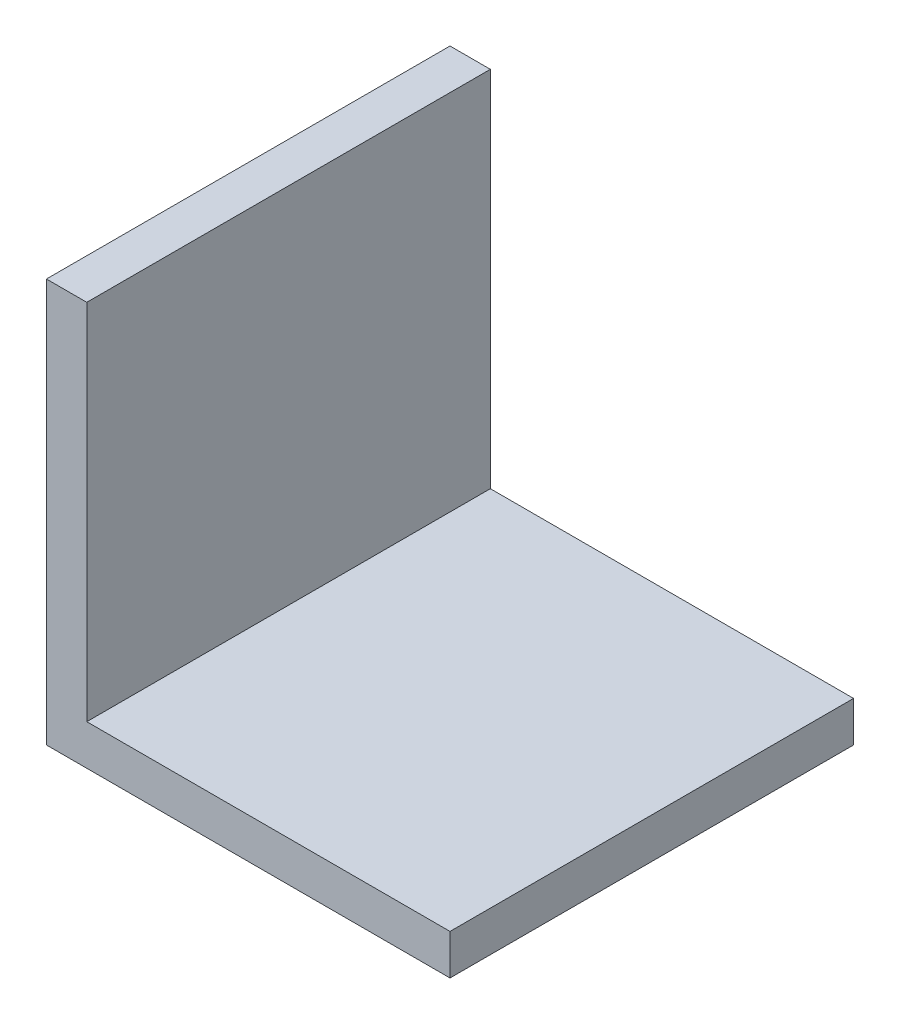
ISO-10303-21;
HEADER;
FILE_DESCRIPTION(('STEP AP214'),'2;1');
FILE_NAME('part.step','',(''),(''),'','','');
FILE_SCHEMA(('AUTOMOTIVE_DESIGN { 1 0 10303 214 1 1 1 1 }'));
ENDSEC;
DATA;
#1=APPLICATION_CONTEXT('core data for automotive mechanical design processes');
#2=APPLICATION_PROTOCOL_DEFINITION('international standard','automotive_design',2000,#1);
#3=PRODUCT_CONTEXT('',#1,'mechanical');
#4=PRODUCT('Part','Part','',(#3));
#5=PRODUCT_RELATED_PRODUCT_CATEGORY('part','',(#4));
#6=PRODUCT_DEFINITION_FORMATION('','',#4);
#7=PRODUCT_DEFINITION_CONTEXT('part definition',#1,'design');
#8=PRODUCT_DEFINITION('design','',#6,#7);
#9=PRODUCT_DEFINITION_SHAPE('','',#8);
#10=(LENGTH_UNIT() NAMED_UNIT(*) SI_UNIT(.MILLI.,.METRE.));
#11=(NAMED_UNIT(*) PLANE_ANGLE_UNIT() SI_UNIT($,.RADIAN.));
#12=(NAMED_UNIT(*) SI_UNIT($,.STERADIAN.) SOLID_ANGLE_UNIT());
#13=UNCERTAINTY_MEASURE_WITH_UNIT(LENGTH_MEASURE(1.E-05),#10,'distance_accuracy_value','');
#14=(GEOMETRIC_REPRESENTATION_CONTEXT(3) GLOBAL_UNCERTAINTY_ASSIGNED_CONTEXT((#13)) GLOBAL_UNIT_ASSIGNED_CONTEXT((#10,
#11,#12)) REPRESENTATION_CONTEXT('',''));
#15=CARTESIAN_POINT('',(0.,0.,0.));
#16=DIRECTION('',(0.,0.,1.));
#17=DIRECTION('',(1.,0.,0.));
#18=AXIS2_PLACEMENT_3D('',#15,#16,#17);
#19=CARTESIAN_POINT('',(-75.026365988947,30.,20.8867740353753));
#20=DIRECTION('',(0.,0.,-1.));
#21=DIRECTION('',(-1.,0.,0.));
#22=AXIS2_PLACEMENT_3D('',#19,#20,#21);
#23=PLANE('',#22);
#24=DIRECTION('',(1.,0.,0.));
#25=VECTOR('',#24,1.);
#26=CARTESIAN_POINT('',(-75.026365988947,3.,20.8867740353753));
#27=LINE('',#26,#25);
#28=CARTESIAN_POINT('',(-72.026365988947,3.,20.8867740353753));
#29=VERTEX_POINT('',#28);
#30=CARTESIAN_POINT('',(-45.026365988947,3.,20.8867740353753));
#31=VERTEX_POINT('',#30);
#32=EDGE_CURVE('E129',#29,#31,#27,.T.);
#33=ORIENTED_EDGE('',*,*,#32,.F.);
#34=DIRECTION('',(0.,-1.,0.));
#35=VECTOR('',#34,1.);
#36=CARTESIAN_POINT('',(-72.026365988947,30.,20.8867740353753));
#37=LINE('',#36,#35);
#38=CARTESIAN_POINT('',(-72.026365988947,30.,20.8867740353753));
#39=VERTEX_POINT('',#38);
#40=EDGE_CURVE('E98',#39,#29,#37,.T.);
#41=ORIENTED_EDGE('',*,*,#40,.F.);
#42=DIRECTION('',(1.,0.,0.));
#43=VECTOR('',#42,1.);
#44=CARTESIAN_POINT('',(-75.026365988947,30.,20.8867740353753));
#45=LINE('',#44,#43);
#46=CARTESIAN_POINT('',(-75.026365988947,30.,20.8867740353753));
#47=VERTEX_POINT('',#46);
#48=EDGE_CURVE('E118',#47,#39,#45,.T.);
#49=ORIENTED_EDGE('',*,*,#48,.F.);
#50=DIRECTION('',(0.,-1.,0.));
#51=VECTOR('',#50,1.);
#52=CARTESIAN_POINT('',(-75.026365988947,30.,20.8867740353753));
#53=LINE('',#52,#51);
#54=CARTESIAN_POINT('',(-75.026365988947,0.,20.8867740353753));
#55=VERTEX_POINT('',#54);
#56=EDGE_CURVE('E11',#47,#55,#53,.T.);
#57=ORIENTED_EDGE('',*,*,#56,.T.);
#58=DIRECTION('',(1.,0.,0.));
#59=VECTOR('',#58,1.);
#60=CARTESIAN_POINT('',(-75.026365988947,0.,20.8867740353753));
#61=LINE('',#60,#59);
#62=CARTESIAN_POINT('',(-45.026365988947,0.,20.8867740353753));
#63=VERTEX_POINT('',#62);
#64=EDGE_CURVE('E97',#55,#63,#61,.T.);
#65=ORIENTED_EDGE('',*,*,#64,.T.);
#66=DIRECTION('',(0.,-1.,0.));
#67=VECTOR('',#66,1.);
#68=CARTESIAN_POINT('',(-45.026365988947,30.,20.8867740353753));
#69=LINE('',#68,#67);
#70=EDGE_CURVE('E41',#31,#63,#69,.T.);
#71=ORIENTED_EDGE('',*,*,#70,.F.);
#72=EDGE_LOOP('',(#33,#41,#49,#57,#65,#71));
#73=FACE_BOUND('',#72,.T.);
#74=ADVANCED_FACE('F33',(#73),#23,.F.);
#75=CARTESIAN_POINT('',(-45.026365988947,30.,-9.11322596462469));
#76=DIRECTION('',(-1.,0.,0.));
#77=DIRECTION('',(0.,0.,1.));
#78=AXIS2_PLACEMENT_3D('',#75,#76,#77);
#79=PLANE('',#78);
#80=DIRECTION('',(0.,0.,-1.));
#81=VECTOR('',#80,1.);
#82=CARTESIAN_POINT('',(-45.026365988947,3.,-9.11322596462469));
#83=LINE('',#82,#81);
#84=CARTESIAN_POINT('',(-45.026365988947,3.,-9.11322596462469));
#85=VERTEX_POINT('',#84);
#86=EDGE_CURVE('E113',#31,#85,#83,.T.);
#87=ORIENTED_EDGE('',*,*,#86,.F.);
#88=ORIENTED_EDGE('',*,*,#70,.T.);
#89=DIRECTION('',(0.,0.,-1.));
#90=VECTOR('',#89,1.);
#91=CARTESIAN_POINT('',(-45.026365988947,0.,-9.11322596462469));
#92=LINE('',#91,#90);
#93=CARTESIAN_POINT('',(-45.026365988947,0.,-9.11322596462469));
#94=VERTEX_POINT('',#93);
#95=EDGE_CURVE('E88',#63,#94,#92,.T.);
#96=ORIENTED_EDGE('',*,*,#95,.T.);
#97=DIRECTION('',(0.,-1.,0.));
#98=VECTOR('',#97,1.);
#99=CARTESIAN_POINT('',(-45.026365988947,30.,-9.11322596462469));
#100=LINE('',#99,#98);
#101=EDGE_CURVE('E82',#85,#94,#100,.T.);
#102=ORIENTED_EDGE('',*,*,#101,.F.);
#103=EDGE_LOOP('',(#87,#88,#96,#102));
#104=FACE_BOUND('',#103,.T.);
#105=ADVANCED_FACE('F110',(#104),#79,.F.);
#106=CARTESIAN_POINT('',(-75.026365988947,30.,-9.11322596462469));
#107=DIRECTION('',(0.,0.,1.));
#108=DIRECTION('',(1.,0.,0.));
#109=AXIS2_PLACEMENT_3D('',#106,#107,#108);
#110=PLANE('',#109);
#111=DIRECTION('',(-1.,0.,0.));
#112=VECTOR('',#111,1.);
#113=CARTESIAN_POINT('',(-75.026365988947,3.,-9.11322596462469));
#114=LINE('',#113,#112);
#115=CARTESIAN_POINT('',(-72.026365988947,3.,-9.11322596462469));
#116=VERTEX_POINT('',#115);
#117=EDGE_CURVE('E124',#85,#116,#114,.T.);
#118=ORIENTED_EDGE('',*,*,#117,.F.);
#119=ORIENTED_EDGE('',*,*,#101,.T.);
#120=DIRECTION('',(-1.,0.,0.));
#121=VECTOR('',#120,1.);
#122=CARTESIAN_POINT('',(-75.026365988947,0.,-9.11322596462469));
#123=LINE('',#122,#121);
#124=CARTESIAN_POINT('',(-75.026365988947,0.,-9.11322596462469));
#125=VERTEX_POINT('',#124);
#126=EDGE_CURVE('E75',#94,#125,#123,.T.);
#127=ORIENTED_EDGE('',*,*,#126,.T.);
#128=DIRECTION('',(0.,-1.,0.));
#129=VECTOR('',#128,1.);
#130=CARTESIAN_POINT('',(-75.026365988947,30.,-9.11322596462469));
#131=LINE('',#130,#129);
#132=CARTESIAN_POINT('',(-75.026365988947,30.,-9.11322596462469));
#133=VERTEX_POINT('',#132);
#134=EDGE_CURVE('E79',#133,#125,#131,.T.);
#135=ORIENTED_EDGE('',*,*,#134,.F.);
#136=DIRECTION('',(-1.,0.,0.));
#137=VECTOR('',#136,1.);
#138=CARTESIAN_POINT('',(-75.026365988947,30.,-9.11322596462469));
#139=LINE('',#138,#137);
#140=CARTESIAN_POINT('',(-72.026365988947,30.,-9.11322596462469));
#141=VERTEX_POINT('',#140);
#142=EDGE_CURVE('E56',#141,#133,#139,.T.);
#143=ORIENTED_EDGE('',*,*,#142,.F.);
#144=DIRECTION('',(0.,-1.,0.));
#145=VECTOR('',#144,1.);
#146=CARTESIAN_POINT('',(-72.026365988947,30.,-9.11322596462469));
#147=LINE('',#146,#145);
#148=EDGE_CURVE('E48',#141,#116,#147,.T.);
#149=ORIENTED_EDGE('',*,*,#148,.T.);
#150=EDGE_LOOP('',(#118,#119,#127,#135,#143,#149));
#151=FACE_BOUND('',#150,.T.);
#152=ADVANCED_FACE('F78',(#151),#110,.F.);
#153=CARTESIAN_POINT('',(-75.026365988947,30.,-9.11322596462469));
#154=DIRECTION('',(1.,0.,0.));
#155=DIRECTION('',(0.,0.,-1.));
#156=AXIS2_PLACEMENT_3D('',#153,#154,#155);
#157=PLANE('',#156);
#158=DIRECTION('',(0.,0.,1.));
#159=VECTOR('',#158,1.);
#160=CARTESIAN_POINT('',(-75.026365988947,0.,-9.11322596462469));
#161=LINE('',#160,#159);
#162=EDGE_CURVE('E93',#125,#55,#161,.T.);
#163=ORIENTED_EDGE('',*,*,#162,.T.);
#164=ORIENTED_EDGE('',*,*,#56,.F.);
#165=DIRECTION('',(0.,0.,1.));
#166=VECTOR('',#165,1.);
#167=CARTESIAN_POINT('',(-75.026365988947,30.,-9.11322596462469));
#168=LINE('',#167,#166);
#169=EDGE_CURVE('E87',#133,#47,#168,.T.);
#170=ORIENTED_EDGE('',*,*,#169,.F.);
#171=ORIENTED_EDGE('',*,*,#134,.T.);
#172=EDGE_LOOP('',(#163,#164,#170,#171));
#173=FACE_BOUND('',#172,.T.);
#174=ADVANCED_FACE('F35',(#173),#157,.F.);
#175=CARTESIAN_POINT('',(0.,30.,0.));
#176=DIRECTION('',(0.,1.,0.));
#177=DIRECTION('',(0.,0.,1.));
#178=AXIS2_PLACEMENT_3D('',#175,#176,#177);
#179=PLANE('',#178);
#180=DIRECTION('',(0.,0.,1.));
#181=VECTOR('',#180,1.);
#182=CARTESIAN_POINT('',(-72.026365988947,30.,-9.11322596462469));
#183=LINE('',#182,#181);
#184=EDGE_CURVE('E122',#141,#39,#183,.T.);
#185=ORIENTED_EDGE('',*,*,#184,.F.);
#186=ORIENTED_EDGE('',*,*,#142,.T.);
#187=ORIENTED_EDGE('',*,*,#169,.T.);
#188=ORIENTED_EDGE('',*,*,#48,.T.);
#189=EDGE_LOOP('',(#185,#186,#187,#188));
#190=FACE_BOUND('',#189,.T.);
#191=ADVANCED_FACE('F119',(#190),#179,.T.);
#192=CARTESIAN_POINT('',(0.,0.,0.));
#193=DIRECTION('',(0.,1.,0.));
#194=DIRECTION('',(0.,0.,1.));
#195=AXIS2_PLACEMENT_3D('',#192,#193,#194);
#196=PLANE('',#195);
#197=ORIENTED_EDGE('',*,*,#162,.F.);
#198=ORIENTED_EDGE('',*,*,#126,.F.);
#199=ORIENTED_EDGE('',*,*,#95,.F.);
#200=ORIENTED_EDGE('',*,*,#64,.F.);
#201=EDGE_LOOP('',(#197,#198,#199,#200));
#202=FACE_BOUND('',#201,.T.);
#203=ADVANCED_FACE('F95',(#202),#196,.F.);
#204=CARTESIAN_POINT('',(-72.026365988947,30.,-9.11322596462469));
#205=DIRECTION('',(1.,0.,0.));
#206=DIRECTION('',(0.,0.,-1.));
#207=AXIS2_PLACEMENT_3D('',#204,#205,#206);
#208=PLANE('',#207);
#209=DIRECTION('',(0.,0.,1.));
#210=VECTOR('',#209,1.);
#211=CARTESIAN_POINT('',(-72.026365988947,3.,-9.11322596462469));
#212=LINE('',#211,#210);
#213=EDGE_CURVE('E131',#116,#29,#212,.T.);
#214=ORIENTED_EDGE('',*,*,#213,.F.);
#215=ORIENTED_EDGE('',*,*,#148,.F.);
#216=ORIENTED_EDGE('',*,*,#184,.T.);
#217=ORIENTED_EDGE('',*,*,#40,.T.);
#218=EDGE_LOOP('',(#214,#215,#216,#217));
#219=FACE_BOUND('',#218,.T.);
#220=ADVANCED_FACE('F139',(#219),#208,.T.);
#221=CARTESIAN_POINT('',(0.,3.,0.));
#222=DIRECTION('',(0.,1.,0.));
#223=DIRECTION('',(0.,0.,1.));
#224=AXIS2_PLACEMENT_3D('',#221,#222,#223);
#225=PLANE('',#224);
#226=ORIENTED_EDGE('',*,*,#213,.T.);
#227=ORIENTED_EDGE('',*,*,#32,.T.);
#228=ORIENTED_EDGE('',*,*,#86,.T.);
#229=ORIENTED_EDGE('',*,*,#117,.T.);
#230=EDGE_LOOP('',(#226,#227,#228,#229));
#231=FACE_BOUND('',#230,.T.);
#232=ADVANCED_FACE('F136',(#231),#225,.T.);
#233=CLOSED_SHELL('',(#74,#105,#152,#174,#191,#203,#220,#232));
#234=MANIFOLD_SOLID_BREP('B2',#233);
#235=ADVANCED_BREP_SHAPE_REPRESENTATION('',(#18,#234),#14);
#236=SHAPE_DEFINITION_REPRESENTATION(#9,#235);
ENDSEC;
END-ISO-10303-21;
